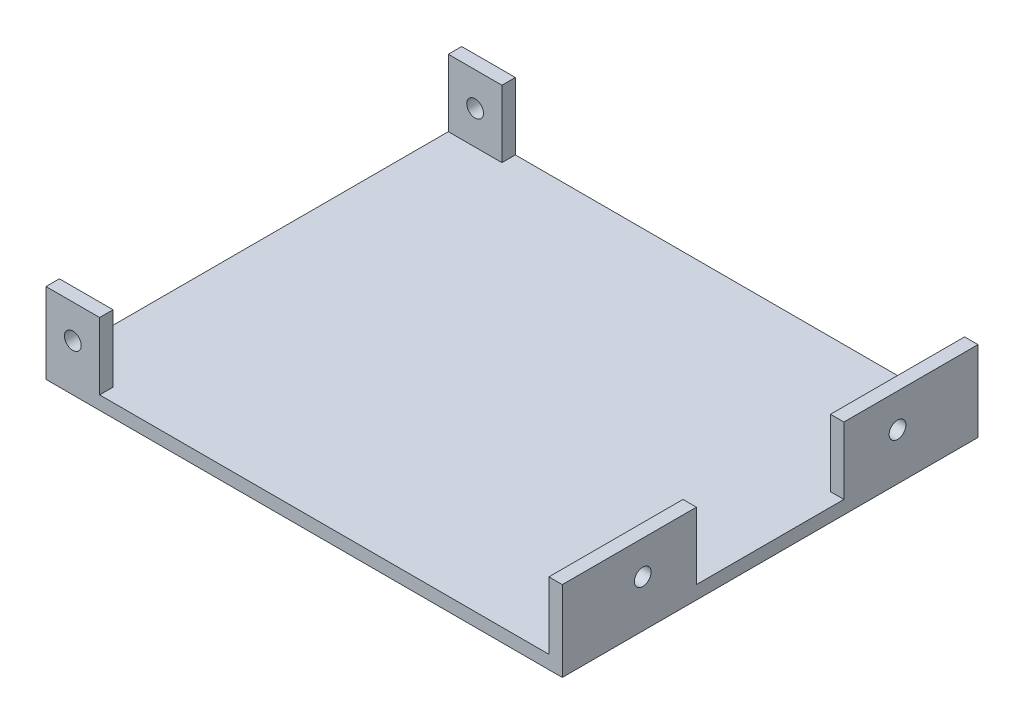
ISO-10303-21;
HEADER;
FILE_DESCRIPTION(('STEP AP214'),'2;1');
FILE_NAME('part.step','',(''),(''),'','','');
FILE_SCHEMA(('AUTOMOTIVE_DESIGN { 1 0 10303 214 1 1 1 1 }'));
ENDSEC;
DATA;
#1=APPLICATION_CONTEXT('core data for automotive mechanical design processes');
#2=APPLICATION_PROTOCOL_DEFINITION('international standard','automotive_design',2000,#1);
#3=PRODUCT_CONTEXT('',#1,'mechanical');
#4=PRODUCT('Part','Part','',(#3));
#5=PRODUCT_RELATED_PRODUCT_CATEGORY('part','',(#4));
#6=PRODUCT_DEFINITION_FORMATION('','',#4);
#7=PRODUCT_DEFINITION_CONTEXT('part definition',#1,'design');
#8=PRODUCT_DEFINITION('design','',#6,#7);
#9=PRODUCT_DEFINITION_SHAPE('','',#8);
#10=(LENGTH_UNIT() NAMED_UNIT(*) SI_UNIT(.MILLI.,.METRE.));
#11=(NAMED_UNIT(*) PLANE_ANGLE_UNIT() SI_UNIT($,.RADIAN.));
#12=(NAMED_UNIT(*) SI_UNIT($,.STERADIAN.) SOLID_ANGLE_UNIT());
#13=UNCERTAINTY_MEASURE_WITH_UNIT(LENGTH_MEASURE(1.E-05),#10,'distance_accuracy_value','');
#14=(GEOMETRIC_REPRESENTATION_CONTEXT(3) GLOBAL_UNCERTAINTY_ASSIGNED_CONTEXT((#13)) GLOBAL_UNIT_ASSIGNED_CONTEXT((#10,
#11,#12)) REPRESENTATION_CONTEXT('',''));
#15=CARTESIAN_POINT('',(0.,0.,0.));
#16=DIRECTION('',(0.,0.,1.));
#17=DIRECTION('',(1.,0.,0.));
#18=AXIS2_PLACEMENT_3D('',#15,#16,#17);
#19=CARTESIAN_POINT('',(0.,2.,0.));
#20=DIRECTION('',(0.,1.,0.));
#21=DIRECTION('',(0.,0.,1.));
#22=AXIS2_PLACEMENT_3D('',#19,#20,#21);
#23=PLANE('',#22);
#24=DIRECTION('',(0.,0.,1.));
#25=VECTOR('',#24,1.);
#26=CARTESIAN_POINT('',(-34.6952462244227,2.,13.1504824105864));
#27=LINE('',#26,#25);
#28=CARTESIAN_POINT('',(-34.6952462244227,2.,13.1504824105864));
#29=VERTEX_POINT('',#28);
#30=CARTESIAN_POINT('',(-34.6952462244227,2.,15.1504824105864));
#31=VERTEX_POINT('',#30);
#32=EDGE_CURVE('E161',#29,#31,#27,.T.);
#33=ORIENTED_EDGE('',*,*,#32,.T.);
#34=DIRECTION('',(1.,0.,0.));
#35=VECTOR('',#34,1.);
#36=CARTESIAN_POINT('',(-42.6952462244227,2.,15.1504824105864));
#37=LINE('',#36,#35);
#38=CARTESIAN_POINT('',(32.3047537755773,2.,15.1504824105864));
#39=VERTEX_POINT('',#38);
#40=EDGE_CURVE('E148',#31,#39,#37,.T.);
#41=ORIENTED_EDGE('',*,*,#40,.T.);
#42=DIRECTION('',(0.,0.,1.));
#43=VECTOR('',#42,1.);
#44=CARTESIAN_POINT('',(32.3047537755773,2.,-4.84951758941357));
#45=LINE('',#44,#43);
#46=CARTESIAN_POINT('',(32.3047537755773,2.,-4.84951758941357));
#47=VERTEX_POINT('',#46);
#48=EDGE_CURVE('E195',#47,#39,#45,.T.);
#49=ORIENTED_EDGE('',*,*,#48,.F.);
#50=DIRECTION('',(1.,0.,0.));
#51=VECTOR('',#50,1.);
#52=CARTESIAN_POINT('',(32.3047537755773,2.,-4.84951758941357));
#53=LINE('',#52,#51);
#54=CARTESIAN_POINT('',(34.3047537755773,2.,-4.84951758941357));
#55=VERTEX_POINT('',#54);
#56=EDGE_CURVE('E197',#47,#55,#53,.T.);
#57=ORIENTED_EDGE('',*,*,#56,.T.);
#58=DIRECTION('',(0.,0.,-1.));
#59=VECTOR('',#58,1.);
#60=CARTESIAN_POINT('',(34.3047537755773,2.,-46.8495175894136));
#61=LINE('',#60,#59);
#62=CARTESIAN_POINT('',(34.3047537755773,2.,-26.8495175894136));
#63=VERTEX_POINT('',#62);
#64=EDGE_CURVE('E158',#55,#63,#61,.T.);
#65=ORIENTED_EDGE('',*,*,#64,.T.);
#66=DIRECTION('',(1.,0.,0.));
#67=VECTOR('',#66,1.);
#68=CARTESIAN_POINT('',(32.3047537755773,2.,-26.8495175894136));
#69=LINE('',#68,#67);
#70=CARTESIAN_POINT('',(32.3047537755773,2.,-26.8495175894136));
#71=VERTEX_POINT('',#70);
#72=EDGE_CURVE('E221',#71,#63,#69,.T.);
#73=ORIENTED_EDGE('',*,*,#72,.F.);
#74=DIRECTION('',(0.,0.,1.));
#75=VECTOR('',#74,1.);
#76=CARTESIAN_POINT('',(32.3047537755773,2.,-46.8495175894136));
#77=LINE('',#76,#75);
#78=CARTESIAN_POINT('',(32.3047537755773,2.,-46.8495175894136));
#79=VERTEX_POINT('',#78);
#80=EDGE_CURVE('E219',#79,#71,#77,.T.);
#81=ORIENTED_EDGE('',*,*,#80,.F.);
#82=DIRECTION('',(-1.,0.,0.));
#83=VECTOR('',#82,1.);
#84=CARTESIAN_POINT('',(-42.6952462244227,2.,-46.8495175894136));
#85=LINE('',#84,#83);
#86=CARTESIAN_POINT('',(-34.6952462244227,2.,-46.8495175894136));
#87=VERTEX_POINT('',#86);
#88=EDGE_CURVE('E260',#79,#87,#85,.T.);
#89=ORIENTED_EDGE('',*,*,#88,.T.);
#90=DIRECTION('',(0.,0.,1.));
#91=VECTOR('',#90,1.);
#92=CARTESIAN_POINT('',(-34.6952462244227,2.,-46.8495175894136));
#93=LINE('',#92,#91);
#94=CARTESIAN_POINT('',(-34.6952462244227,2.,-44.8495175894136));
#95=VERTEX_POINT('',#94);
#96=EDGE_CURVE('E237',#87,#95,#93,.T.);
#97=ORIENTED_EDGE('',*,*,#96,.T.);
#98=DIRECTION('',(1.,0.,0.));
#99=VECTOR('',#98,1.);
#100=CARTESIAN_POINT('',(-42.6952462244227,2.,-44.8495175894136));
#101=LINE('',#100,#99);
#102=CARTESIAN_POINT('',(-42.6952462244227,2.,-44.8495175894136));
#103=VERTEX_POINT('',#102);
#104=EDGE_CURVE('E225',#103,#95,#101,.T.);
#105=ORIENTED_EDGE('',*,*,#104,.F.);
#106=DIRECTION('',(0.,0.,1.));
#107=VECTOR('',#106,1.);
#108=CARTESIAN_POINT('',(-42.6952462244227,2.,-46.8495175894136));
#109=LINE('',#108,#107);
#110=CARTESIAN_POINT('',(-42.6952462244227,2.,13.1504824105864));
#111=VERTEX_POINT('',#110);
#112=EDGE_CURVE('E54',#103,#111,#109,.T.);
#113=ORIENTED_EDGE('',*,*,#112,.T.);
#114=DIRECTION('',(1.,0.,0.));
#115=VECTOR('',#114,1.);
#116=CARTESIAN_POINT('',(-42.6952462244227,2.,13.1504824105864));
#117=LINE('',#116,#115);
#118=EDGE_CURVE('E49',#111,#29,#117,.T.);
#119=ORIENTED_EDGE('',*,*,#118,.T.);
#120=EDGE_LOOP('',(#33,#41,#49,#57,#65,#73,#81,#89,#97,#105,#113,#119));
#121=FACE_BOUND('',#120,.T.);
#122=ADVANCED_FACE('F33',(#121),#23,.T.);
#123=CARTESIAN_POINT('',(-42.6952462244227,2.,-46.8495175894136));
#124=DIRECTION('',(1.,0.,0.));
#125=DIRECTION('',(0.,0.,-1.));
#126=AXIS2_PLACEMENT_3D('',#123,#124,#125);
#127=PLANE('',#126);
#128=DIRECTION('',(0.,0.,1.));
#129=VECTOR('',#128,1.);
#130=CARTESIAN_POINT('',(-42.6952462244227,0.,-46.8495175894136));
#131=LINE('',#130,#129);
#132=CARTESIAN_POINT('',(-42.6952462244227,0.,-46.8495175894136));
#133=VERTEX_POINT('',#132);
#134=CARTESIAN_POINT('',(-42.6952462244227,0.,15.1504824105864));
#135=VERTEX_POINT('',#134);
#136=EDGE_CURVE('E256',#133,#135,#131,.T.);
#137=ORIENTED_EDGE('',*,*,#136,.T.);
#138=DIRECTION('',(0.,-1.,0.));
#139=VECTOR('',#138,1.);
#140=CARTESIAN_POINT('',(-42.6952462244227,2.,15.1504824105864));
#141=LINE('',#140,#139);
#142=CARTESIAN_POINT('',(-42.6952462244227,12.,15.1504824105864));
#143=VERTEX_POINT('',#142);
#144=EDGE_CURVE('E11',#143,#135,#141,.T.);
#145=ORIENTED_EDGE('',*,*,#144,.F.);
#146=DIRECTION('',(0.,0.,1.));
#147=VECTOR('',#146,1.);
#148=CARTESIAN_POINT('',(-42.6952462244227,12.,13.1504824105864));
#149=LINE('',#148,#147);
#150=CARTESIAN_POINT('',(-42.6952462244227,12.,13.1504824105864));
#151=VERTEX_POINT('',#150);
#152=EDGE_CURVE('E178',#151,#143,#149,.T.);
#153=ORIENTED_EDGE('',*,*,#152,.F.);
#154=DIRECTION('',(0.,-1.,0.));
#155=VECTOR('',#154,1.);
#156=CARTESIAN_POINT('',(-42.6952462244227,12.,13.1504824105864));
#157=LINE('',#156,#155);
#158=EDGE_CURVE('E171',#151,#111,#157,.T.);
#159=ORIENTED_EDGE('',*,*,#158,.T.);
#160=ORIENTED_EDGE('',*,*,#112,.F.);
#161=DIRECTION('',(0.,-1.,0.));
#162=VECTOR('',#161,1.);
#163=CARTESIAN_POINT('',(-42.6952462244227,12.,-44.8495175894136));
#164=LINE('',#163,#162);
#165=CARTESIAN_POINT('',(-42.6952462244227,12.,-44.8495175894136));
#166=VERTEX_POINT('',#165);
#167=EDGE_CURVE('E245',#166,#103,#164,.T.);
#168=ORIENTED_EDGE('',*,*,#167,.F.);
#169=DIRECTION('',(0.,0.,1.));
#170=VECTOR('',#169,1.);
#171=CARTESIAN_POINT('',(-42.6952462244227,12.,-46.8495175894136));
#172=LINE('',#171,#170);
#173=CARTESIAN_POINT('',(-42.6952462244227,12.,-46.8495175894136));
#174=VERTEX_POINT('',#173);
#175=EDGE_CURVE('E243',#174,#166,#172,.T.);
#176=ORIENTED_EDGE('',*,*,#175,.F.);
#177=DIRECTION('',(0.,-1.,0.));
#178=VECTOR('',#177,1.);
#179=CARTESIAN_POINT('',(-42.6952462244227,2.,-46.8495175894136));
#180=LINE('',#179,#178);
#181=EDGE_CURVE('E262',#174,#133,#180,.T.);
#182=ORIENTED_EDGE('',*,*,#181,.T.);
#183=EDGE_LOOP('',(#137,#145,#153,#159,#160,#168,#176,#182));
#184=FACE_BOUND('',#183,.T.);
#185=ADVANCED_FACE('F35',(#184),#127,.F.);
#186=CARTESIAN_POINT('',(-42.6952462244227,2.,15.1504824105864));
#187=DIRECTION('',(0.,0.,-1.));
#188=DIRECTION('',(-1.,0.,0.));
#189=AXIS2_PLACEMENT_3D('',#186,#187,#188);
#190=PLANE('',#189);
#191=CARTESIAN_POINT('',(-38.6952462244227,7.,15.1504824105864));
#192=DIRECTION('',(0.,0.,1.));
#193=DIRECTION('',(1.,0.,0.));
#194=AXIS2_PLACEMENT_3D('',#191,#192,#193);
#195=CIRCLE('',#194,1.25);
#196=CARTESIAN_POINT('',(-37.4452462244227,7.,15.1504824105864));
#197=VERTEX_POINT('',#196);
#198=EDGE_CURVE('E354',#197,#197,#195,.T.);
#199=ORIENTED_EDGE('',*,*,#198,.F.);
#200=EDGE_LOOP('',(#199));
#201=FACE_BOUND('',#200,.T.);
#202=DIRECTION('',(1.,0.,0.));
#203=VECTOR('',#202,1.);
#204=CARTESIAN_POINT('',(-42.6952462244227,0.,15.1504824105864));
#205=LINE('',#204,#203);
#206=CARTESIAN_POINT('',(34.3047537755773,0.,15.1504824105864));
#207=VERTEX_POINT('',#206);
#208=EDGE_CURVE('E265',#135,#207,#205,.T.);
#209=ORIENTED_EDGE('',*,*,#208,.T.);
#210=DIRECTION('',(0.,-1.,0.));
#211=VECTOR('',#210,1.);
#212=CARTESIAN_POINT('',(34.3047537755773,2.,15.1504824105864));
#213=LINE('',#212,#211);
#214=CARTESIAN_POINT('',(34.3047537755773,12.,15.1504824105864));
#215=VERTEX_POINT('',#214);
#216=EDGE_CURVE('E42',#215,#207,#213,.T.);
#217=ORIENTED_EDGE('',*,*,#216,.F.);
#218=DIRECTION('',(1.,0.,0.));
#219=VECTOR('',#218,1.);
#220=CARTESIAN_POINT('',(32.3047537755773,12.,15.1504824105864));
#221=LINE('',#220,#219);
#222=CARTESIAN_POINT('',(32.3047537755773,12.,15.1504824105864));
#223=VERTEX_POINT('',#222);
#224=EDGE_CURVE('E198',#223,#215,#221,.T.);
#225=ORIENTED_EDGE('',*,*,#224,.F.);
#226=DIRECTION('',(0.,-1.,0.));
#227=VECTOR('',#226,1.);
#228=CARTESIAN_POINT('',(32.3047537755773,12.,15.1504824105864));
#229=LINE('',#228,#227);
#230=EDGE_CURVE('E156',#223,#39,#229,.T.);
#231=ORIENTED_EDGE('',*,*,#230,.T.);
#232=ORIENTED_EDGE('',*,*,#40,.F.);
#233=DIRECTION('',(0.,-1.,0.));
#234=VECTOR('',#233,1.);
#235=CARTESIAN_POINT('',(-34.6952462244227,12.,15.1504824105864));
#236=LINE('',#235,#234);
#237=CARTESIAN_POINT('',(-34.6952462244227,12.,15.1504824105864));
#238=VERTEX_POINT('',#237);
#239=EDGE_CURVE('E152',#238,#31,#236,.T.);
#240=ORIENTED_EDGE('',*,*,#239,.F.);
#241=DIRECTION('',(1.,0.,0.));
#242=VECTOR('',#241,1.);
#243=CARTESIAN_POINT('',(-42.6952462244227,12.,15.1504824105864));
#244=LINE('',#243,#242);
#245=EDGE_CURVE('E179',#143,#238,#244,.T.);
#246=ORIENTED_EDGE('',*,*,#245,.F.);
#247=ORIENTED_EDGE('',*,*,#144,.T.);
#248=EDGE_LOOP('',(#209,#217,#225,#231,#232,#240,#246,#247));
#249=FACE_BOUND('',#248,.T.);
#250=ADVANCED_FACE('F149',(#201,#249),#190,.F.);
#251=CARTESIAN_POINT('',(34.3047537755773,2.,-46.8495175894136));
#252=DIRECTION('',(-1.,0.,0.));
#253=DIRECTION('',(0.,0.,1.));
#254=AXIS2_PLACEMENT_3D('',#251,#252,#253);
#255=PLANE('',#254);
#256=CARTESIAN_POINT('',(34.3047537755773,7.,3.15048241058643));
#257=DIRECTION('',(1.,0.,0.));
#258=DIRECTION('',(0.,0.,-1.));
#259=AXIS2_PLACEMENT_3D('',#256,#257,#258);
#260=CIRCLE('',#259,1.25);
#261=CARTESIAN_POINT('',(34.3047537755773,7.,1.90048241058643));
#262=VERTEX_POINT('',#261);
#263=EDGE_CURVE('E361',#262,#262,#260,.T.);
#264=ORIENTED_EDGE('',*,*,#263,.F.);
#265=EDGE_LOOP('',(#264));
#266=FACE_BOUND('',#265,.T.);
#267=CARTESIAN_POINT('',(34.3047537755773,7.,-34.8495175894136));
#268=DIRECTION('',(1.,0.,0.));
#269=DIRECTION('',(0.,0.,-1.));
#270=AXIS2_PLACEMENT_3D('',#267,#268,#269);
#271=CIRCLE('',#270,1.25);
#272=CARTESIAN_POINT('',(34.3047537755773,7.,-36.0995175894136));
#273=VERTEX_POINT('',#272);
#274=EDGE_CURVE('E367',#273,#273,#271,.T.);
#275=ORIENTED_EDGE('',*,*,#274,.F.);
#276=EDGE_LOOP('',(#275));
#277=FACE_BOUND('',#276,.T.);
#278=DIRECTION('',(0.,0.,-1.));
#279=VECTOR('',#278,1.);
#280=CARTESIAN_POINT('',(34.3047537755773,0.,-46.8495175894136));
#281=LINE('',#280,#279);
#282=CARTESIAN_POINT('',(34.3047537755773,0.,-46.8495175894136));
#283=VERTEX_POINT('',#282);
#284=EDGE_CURVE('E267',#207,#283,#281,.T.);
#285=ORIENTED_EDGE('',*,*,#284,.T.);
#286=DIRECTION('',(0.,-1.,0.));
#287=VECTOR('',#286,1.);
#288=CARTESIAN_POINT('',(34.3047537755773,2.,-46.8495175894136));
#289=LINE('',#288,#287);
#290=CARTESIAN_POINT('',(34.3047537755773,12.,-46.8495175894136));
#291=VERTEX_POINT('',#290);
#292=EDGE_CURVE('E272',#291,#283,#289,.T.);
#293=ORIENTED_EDGE('',*,*,#292,.F.);
#294=DIRECTION('',(0.,0.,1.));
#295=VECTOR('',#294,1.);
#296=CARTESIAN_POINT('',(34.3047537755773,12.,-46.8495175894136));
#297=LINE('',#296,#295);
#298=CARTESIAN_POINT('',(34.3047537755773,12.,-26.8495175894136));
#299=VERTEX_POINT('',#298);
#300=EDGE_CURVE('E230',#291,#299,#297,.T.);
#301=ORIENTED_EDGE('',*,*,#300,.T.);
#302=DIRECTION('',(0.,-1.,0.));
#303=VECTOR('',#302,1.);
#304=CARTESIAN_POINT('',(34.3047537755773,12.,-26.8495175894136));
#305=LINE('',#304,#303);
#306=EDGE_CURVE('E201',#299,#63,#305,.T.);
#307=ORIENTED_EDGE('',*,*,#306,.T.);
#308=ORIENTED_EDGE('',*,*,#64,.F.);
#309=DIRECTION('',(0.,-1.,0.));
#310=VECTOR('',#309,1.);
#311=CARTESIAN_POINT('',(34.3047537755773,12.,-4.84951758941357));
#312=LINE('',#311,#310);
#313=CARTESIAN_POINT('',(34.3047537755773,12.,-4.84951758941357));
#314=VERTEX_POINT('',#313);
#315=EDGE_CURVE('E163',#314,#55,#312,.T.);
#316=ORIENTED_EDGE('',*,*,#315,.F.);
#317=DIRECTION('',(0.,0.,1.));
#318=VECTOR('',#317,1.);
#319=CARTESIAN_POINT('',(34.3047537755773,12.,-4.84951758941357));
#320=LINE('',#319,#318);
#321=EDGE_CURVE('E206',#314,#215,#320,.T.);
#322=ORIENTED_EDGE('',*,*,#321,.T.);
#323=ORIENTED_EDGE('',*,*,#216,.T.);
#324=EDGE_LOOP('',(#285,#293,#301,#307,#308,#316,#322,#323));
#325=FACE_BOUND('',#324,.T.);
#326=ADVANCED_FACE('F278',(#266,#277,#325),#255,.F.);
#327=CARTESIAN_POINT('',(-42.6952462244227,2.,-46.8495175894136));
#328=DIRECTION('',(0.,0.,1.));
#329=DIRECTION('',(1.,0.,0.));
#330=AXIS2_PLACEMENT_3D('',#327,#328,#329);
#331=PLANE('',#330);
#332=CARTESIAN_POINT('',(-38.6952462244227,7.,-46.8495175894136));
#333=DIRECTION('',(0.,0.,1.));
#334=DIRECTION('',(1.,0.,0.));
#335=AXIS2_PLACEMENT_3D('',#332,#333,#334);
#336=CIRCLE('',#335,1.25);
#337=CARTESIAN_POINT('',(-37.4452462244227,7.,-46.8495175894136));
#338=VERTEX_POINT('',#337);
#339=EDGE_CURVE('E356',#338,#338,#336,.T.);
#340=ORIENTED_EDGE('',*,*,#339,.T.);
#341=EDGE_LOOP('',(#340));
#342=FACE_BOUND('',#341,.T.);
#343=DIRECTION('',(-1.,0.,0.));
#344=VECTOR('',#343,1.);
#345=CARTESIAN_POINT('',(-42.6952462244227,0.,-46.8495175894136));
#346=LINE('',#345,#344);
#347=EDGE_CURVE('E257',#283,#133,#346,.T.);
#348=ORIENTED_EDGE('',*,*,#347,.T.);
#349=ORIENTED_EDGE('',*,*,#181,.F.);
#350=DIRECTION('',(1.,0.,0.));
#351=VECTOR('',#350,1.);
#352=CARTESIAN_POINT('',(-42.6952462244227,12.,-46.8495175894136));
#353=LINE('',#352,#351);
#354=CARTESIAN_POINT('',(-34.6952462244227,12.,-46.8495175894136));
#355=VERTEX_POINT('',#354);
#356=EDGE_CURVE('E240',#174,#355,#353,.T.);
#357=ORIENTED_EDGE('',*,*,#356,.T.);
#358=DIRECTION('',(0.,-1.,0.));
#359=VECTOR('',#358,1.);
#360=CARTESIAN_POINT('',(-34.6952462244227,12.,-46.8495175894136));
#361=LINE('',#360,#359);
#362=EDGE_CURVE('E250',#355,#87,#361,.T.);
#363=ORIENTED_EDGE('',*,*,#362,.T.);
#364=ORIENTED_EDGE('',*,*,#88,.F.);
#365=DIRECTION('',(0.,-1.,0.));
#366=VECTOR('',#365,1.);
#367=CARTESIAN_POINT('',(32.3047537755773,12.,-46.8495175894136));
#368=LINE('',#367,#366);
#369=CARTESIAN_POINT('',(32.3047537755773,12.,-46.8495175894136));
#370=VERTEX_POINT('',#369);
#371=EDGE_CURVE('E213',#370,#79,#368,.T.);
#372=ORIENTED_EDGE('',*,*,#371,.F.);
#373=DIRECTION('',(1.,0.,0.));
#374=VECTOR('',#373,1.);
#375=CARTESIAN_POINT('',(32.3047537755773,12.,-46.8495175894136));
#376=LINE('',#375,#374);
#377=EDGE_CURVE('E227',#370,#291,#376,.T.);
#378=ORIENTED_EDGE('',*,*,#377,.T.);
#379=ORIENTED_EDGE('',*,*,#292,.T.);
#380=EDGE_LOOP('',(#348,#349,#357,#363,#364,#372,#378,#379));
#381=FACE_BOUND('',#380,.T.);
#382=ADVANCED_FACE('F285',(#342,#381),#331,.F.);
#383=CARTESIAN_POINT('',(0.,0.,0.));
#384=DIRECTION('',(0.,1.,0.));
#385=DIRECTION('',(0.,0.,1.));
#386=AXIS2_PLACEMENT_3D('',#383,#384,#385);
#387=PLANE('',#386);
#388=ORIENTED_EDGE('',*,*,#136,.F.);
#389=ORIENTED_EDGE('',*,*,#347,.F.);
#390=ORIENTED_EDGE('',*,*,#284,.F.);
#391=ORIENTED_EDGE('',*,*,#208,.F.);
#392=EDGE_LOOP('',(#388,#389,#390,#391));
#393=FACE_BOUND('',#392,.T.);
#394=ADVANCED_FACE('F283',(#393),#387,.F.);
#395=CARTESIAN_POINT('',(-42.6952462244227,12.,-44.8495175894136));
#396=DIRECTION('',(0.,0.,-1.));
#397=DIRECTION('',(-1.,0.,0.));
#398=AXIS2_PLACEMENT_3D('',#395,#396,#397);
#399=PLANE('',#398);
#400=CARTESIAN_POINT('',(-38.6952462244227,7.,-44.8495175894136));
#401=DIRECTION('',(0.,0.,-1.));
#402=DIRECTION('',(-1.,0.,0.));
#403=AXIS2_PLACEMENT_3D('',#400,#401,#402);
#404=CIRCLE('',#403,1.25);
#405=CARTESIAN_POINT('',(-39.9452462244227,7.,-44.8495175894136));
#406=VERTEX_POINT('',#405);
#407=EDGE_CURVE('E169',#406,#406,#404,.T.);
#408=ORIENTED_EDGE('',*,*,#407,.T.);
#409=EDGE_LOOP('',(#408));
#410=FACE_BOUND('',#409,.T.);
#411=ORIENTED_EDGE('',*,*,#104,.T.);
#412=DIRECTION('',(0.,-1.,0.));
#413=VECTOR('',#412,1.);
#414=CARTESIAN_POINT('',(-34.6952462244227,12.,-44.8495175894136));
#415=LINE('',#414,#413);
#416=CARTESIAN_POINT('',(-34.6952462244227,12.,-44.8495175894136));
#417=VERTEX_POINT('',#416);
#418=EDGE_CURVE('E253',#417,#95,#415,.T.);
#419=ORIENTED_EDGE('',*,*,#418,.F.);
#420=DIRECTION('',(1.,0.,0.));
#421=VECTOR('',#420,1.);
#422=CARTESIAN_POINT('',(-42.6952462244227,12.,-44.8495175894136));
#423=LINE('',#422,#421);
#424=EDGE_CURVE('E234',#166,#417,#423,.T.);
#425=ORIENTED_EDGE('',*,*,#424,.F.);
#426=ORIENTED_EDGE('',*,*,#167,.T.);
#427=EDGE_LOOP('',(#411,#419,#425,#426));
#428=FACE_BOUND('',#427,.T.);
#429=ADVANCED_FACE('F339',(#410,#428),#399,.F.);
#430=CARTESIAN_POINT('',(-34.6952462244227,12.,-46.8495175894136));
#431=DIRECTION('',(1.,0.,0.));
#432=DIRECTION('',(0.,0.,-1.));
#433=AXIS2_PLACEMENT_3D('',#430,#431,#432);
#434=PLANE('',#433);
#435=ORIENTED_EDGE('',*,*,#96,.F.);
#436=ORIENTED_EDGE('',*,*,#362,.F.);
#437=DIRECTION('',(0.,0.,1.));
#438=VECTOR('',#437,1.);
#439=CARTESIAN_POINT('',(-34.6952462244227,12.,-46.8495175894136));
#440=LINE('',#439,#438);
#441=EDGE_CURVE('E236',#355,#417,#440,.T.);
#442=ORIENTED_EDGE('',*,*,#441,.T.);
#443=ORIENTED_EDGE('',*,*,#418,.T.);
#444=EDGE_LOOP('',(#435,#436,#442,#443));
#445=FACE_BOUND('',#444,.T.);
#446=ADVANCED_FACE('F297',(#445),#434,.T.);
#447=CARTESIAN_POINT('',(0.,12.,0.));
#448=DIRECTION('',(0.,-1.,0.));
#449=DIRECTION('',(0.,0.,-1.));
#450=AXIS2_PLACEMENT_3D('',#447,#448,#449);
#451=PLANE('',#450);
#452=ORIENTED_EDGE('',*,*,#424,.T.);
#453=ORIENTED_EDGE('',*,*,#441,.F.);
#454=ORIENTED_EDGE('',*,*,#356,.F.);
#455=ORIENTED_EDGE('',*,*,#175,.T.);
#456=EDGE_LOOP('',(#452,#453,#454,#455));
#457=FACE_BOUND('',#456,.T.);
#458=ADVANCED_FACE('F293',(#457),#451,.F.);
#459=CARTESIAN_POINT('',(32.3047537755773,12.,-26.8495175894136));
#460=DIRECTION('',(0.,0.,-1.));
#461=DIRECTION('',(-1.,0.,0.));
#462=AXIS2_PLACEMENT_3D('',#459,#460,#461);
#463=PLANE('',#462);
#464=ORIENTED_EDGE('',*,*,#72,.T.);
#465=ORIENTED_EDGE('',*,*,#306,.F.);
#466=DIRECTION('',(1.,0.,0.));
#467=VECTOR('',#466,1.);
#468=CARTESIAN_POINT('',(32.3047537755773,12.,-26.8495175894136));
#469=LINE('',#468,#467);
#470=CARTESIAN_POINT('',(32.3047537755773,12.,-26.8495175894136));
#471=VERTEX_POINT('',#470);
#472=EDGE_CURVE('E222',#471,#299,#469,.T.);
#473=ORIENTED_EDGE('',*,*,#472,.F.);
#474=DIRECTION('',(0.,-1.,0.));
#475=VECTOR('',#474,1.);
#476=CARTESIAN_POINT('',(32.3047537755773,12.,-26.8495175894136));
#477=LINE('',#476,#475);
#478=EDGE_CURVE('E215',#471,#71,#477,.T.);
#479=ORIENTED_EDGE('',*,*,#478,.T.);
#480=EDGE_LOOP('',(#464,#465,#473,#479));
#481=FACE_BOUND('',#480,.T.);
#482=ADVANCED_FACE('F307',(#481),#463,.F.);
#483=CARTESIAN_POINT('',(32.3047537755773,12.,-46.8495175894136));
#484=DIRECTION('',(1.,0.,0.));
#485=DIRECTION('',(0.,0.,-1.));
#486=AXIS2_PLACEMENT_3D('',#483,#484,#485);
#487=PLANE('',#486);
#488=CARTESIAN_POINT('',(32.3047537755773,7.,-34.8495175894136));
#489=DIRECTION('',(1.,0.,0.));
#490=DIRECTION('',(0.,0.,-1.));
#491=AXIS2_PLACEMENT_3D('',#488,#489,#490);
#492=CIRCLE('',#491,1.25);
#493=CARTESIAN_POINT('',(32.3047537755773,7.,-36.0995175894136));
#494=VERTEX_POINT('',#493);
#495=EDGE_CURVE('E364',#494,#494,#492,.F.);
#496=ORIENTED_EDGE('',*,*,#495,.F.);
#497=EDGE_LOOP('',(#496));
#498=FACE_BOUND('',#497,.T.);
#499=ORIENTED_EDGE('',*,*,#80,.T.);
#500=ORIENTED_EDGE('',*,*,#478,.F.);
#501=DIRECTION('',(0.,0.,1.));
#502=VECTOR('',#501,1.);
#503=CARTESIAN_POINT('',(32.3047537755773,12.,-46.8495175894136));
#504=LINE('',#503,#502);
#505=EDGE_CURVE('E218',#370,#471,#504,.T.);
#506=ORIENTED_EDGE('',*,*,#505,.F.);
#507=ORIENTED_EDGE('',*,*,#371,.T.);
#508=EDGE_LOOP('',(#499,#500,#506,#507));
#509=FACE_BOUND('',#508,.T.);
#510=ADVANCED_FACE('F303',(#498,#509),#487,.F.);
#511=CARTESIAN_POINT('',(0.,12.,0.));
#512=DIRECTION('',(0.,-1.,0.));
#513=DIRECTION('',(0.,0.,-1.));
#514=AXIS2_PLACEMENT_3D('',#511,#512,#513);
#515=PLANE('',#514);
#516=ORIENTED_EDGE('',*,*,#472,.T.);
#517=ORIENTED_EDGE('',*,*,#300,.F.);
#518=ORIENTED_EDGE('',*,*,#377,.F.);
#519=ORIENTED_EDGE('',*,*,#505,.T.);
#520=EDGE_LOOP('',(#516,#517,#518,#519));
#521=FACE_BOUND('',#520,.T.);
#522=ADVANCED_FACE('F311',(#521),#515,.F.);
#523=CARTESIAN_POINT('',(32.3047537755773,12.,-4.84951758941357));
#524=DIRECTION('',(0.,0.,-1.));
#525=DIRECTION('',(-1.,0.,0.));
#526=AXIS2_PLACEMENT_3D('',#523,#524,#525);
#527=PLANE('',#526);
#528=ORIENTED_EDGE('',*,*,#56,.F.);
#529=DIRECTION('',(0.,-1.,0.));
#530=VECTOR('',#529,1.);
#531=CARTESIAN_POINT('',(32.3047537755773,12.,-4.84951758941357));
#532=LINE('',#531,#530);
#533=CARTESIAN_POINT('',(32.3047537755773,12.,-4.84951758941357));
#534=VERTEX_POINT('',#533);
#535=EDGE_CURVE('E190',#534,#47,#532,.T.);
#536=ORIENTED_EDGE('',*,*,#535,.F.);
#537=DIRECTION('',(1.,0.,0.));
#538=VECTOR('',#537,1.);
#539=CARTESIAN_POINT('',(32.3047537755773,12.,-4.84951758941357));
#540=LINE('',#539,#538);
#541=EDGE_CURVE('E203',#534,#314,#540,.T.);
#542=ORIENTED_EDGE('',*,*,#541,.T.);
#543=ORIENTED_EDGE('',*,*,#315,.T.);
#544=EDGE_LOOP('',(#528,#536,#542,#543));
#545=FACE_BOUND('',#544,.T.);
#546=ADVANCED_FACE('F315',(#545),#527,.T.);
#547=CARTESIAN_POINT('',(32.3047537755773,12.,-4.84951758941357));
#548=DIRECTION('',(1.,0.,0.));
#549=DIRECTION('',(0.,0.,-1.));
#550=AXIS2_PLACEMENT_3D('',#547,#548,#549);
#551=PLANE('',#550);
#552=CARTESIAN_POINT('',(32.3047537755773,7.,3.15048241058643));
#553=DIRECTION('',(1.,0.,0.));
#554=DIRECTION('',(0.,0.,-1.));
#555=AXIS2_PLACEMENT_3D('',#552,#553,#554);
#556=CIRCLE('',#555,1.25);
#557=CARTESIAN_POINT('',(32.3047537755773,7.,1.90048241058643));
#558=VERTEX_POINT('',#557);
#559=EDGE_CURVE('E357',#558,#558,#556,.F.);
#560=ORIENTED_EDGE('',*,*,#559,.F.);
#561=EDGE_LOOP('',(#560));
#562=FACE_BOUND('',#561,.T.);
#563=ORIENTED_EDGE('',*,*,#48,.T.);
#564=ORIENTED_EDGE('',*,*,#230,.F.);
#565=DIRECTION('',(0.,0.,1.));
#566=VECTOR('',#565,1.);
#567=CARTESIAN_POINT('',(32.3047537755773,12.,-4.84951758941357));
#568=LINE('',#567,#566);
#569=EDGE_CURVE('E194',#534,#223,#568,.T.);
#570=ORIENTED_EDGE('',*,*,#569,.F.);
#571=ORIENTED_EDGE('',*,*,#535,.T.);
#572=EDGE_LOOP('',(#563,#564,#570,#571));
#573=FACE_BOUND('',#572,.T.);
#574=ADVANCED_FACE('F321',(#562,#573),#551,.F.);
#575=CARTESIAN_POINT('',(0.,12.,0.));
#576=DIRECTION('',(0.,-1.,0.));
#577=DIRECTION('',(0.,0.,-1.));
#578=AXIS2_PLACEMENT_3D('',#575,#576,#577);
#579=PLANE('',#578);
#580=ORIENTED_EDGE('',*,*,#224,.T.);
#581=ORIENTED_EDGE('',*,*,#321,.F.);
#582=ORIENTED_EDGE('',*,*,#541,.F.);
#583=ORIENTED_EDGE('',*,*,#569,.T.);
#584=EDGE_LOOP('',(#580,#581,#582,#583));
#585=FACE_BOUND('',#584,.T.);
#586=ADVANCED_FACE('F319',(#585),#579,.F.);
#587=CARTESIAN_POINT('',(-34.6952462244227,12.,13.1504824105864));
#588=DIRECTION('',(1.,0.,0.));
#589=DIRECTION('',(0.,0.,-1.));
#590=AXIS2_PLACEMENT_3D('',#587,#588,#589);
#591=PLANE('',#590);
#592=ORIENTED_EDGE('',*,*,#32,.F.);
#593=DIRECTION('',(0.,-1.,0.));
#594=VECTOR('',#593,1.);
#595=CARTESIAN_POINT('',(-34.6952462244227,12.,13.1504824105864));
#596=LINE('',#595,#594);
#597=CARTESIAN_POINT('',(-34.6952462244227,12.,13.1504824105864));
#598=VERTEX_POINT('',#597);
#599=EDGE_CURVE('E168',#598,#29,#596,.T.);
#600=ORIENTED_EDGE('',*,*,#599,.F.);
#601=DIRECTION('',(0.,0.,1.));
#602=VECTOR('',#601,1.);
#603=CARTESIAN_POINT('',(-34.6952462244227,12.,13.1504824105864));
#604=LINE('',#603,#602);
#605=EDGE_CURVE('E167',#598,#238,#604,.T.);
#606=ORIENTED_EDGE('',*,*,#605,.T.);
#607=ORIENTED_EDGE('',*,*,#239,.T.);
#608=EDGE_LOOP('',(#592,#600,#606,#607));
#609=FACE_BOUND('',#608,.T.);
#610=ADVANCED_FACE('F165',(#609),#591,.T.);
#611=CARTESIAN_POINT('',(-42.6952462244227,12.,13.1504824105864));
#612=DIRECTION('',(0.,0.,-1.));
#613=DIRECTION('',(-1.,0.,0.));
#614=AXIS2_PLACEMENT_3D('',#611,#612,#613);
#615=PLANE('',#614);
#616=CARTESIAN_POINT('',(-38.6952462244227,7.,13.1504824105864));
#617=DIRECTION('',(0.,0.,-1.));
#618=DIRECTION('',(-1.,0.,0.));
#619=AXIS2_PLACEMENT_3D('',#616,#617,#618);
#620=CIRCLE('',#619,1.25);
#621=CARTESIAN_POINT('',(-39.9452462244227,7.,13.1504824105864));
#622=VERTEX_POINT('',#621);
#623=EDGE_CURVE('E37',#622,#622,#620,.T.);
#624=ORIENTED_EDGE('',*,*,#623,.F.);
#625=EDGE_LOOP('',(#624));
#626=FACE_BOUND('',#625,.T.);
#627=ORIENTED_EDGE('',*,*,#118,.F.);
#628=ORIENTED_EDGE('',*,*,#158,.F.);
#629=DIRECTION('',(1.,0.,0.));
#630=VECTOR('',#629,1.);
#631=CARTESIAN_POINT('',(-42.6952462244227,12.,13.1504824105864));
#632=LINE('',#631,#630);
#633=EDGE_CURVE('E183',#151,#598,#632,.T.);
#634=ORIENTED_EDGE('',*,*,#633,.T.);
#635=ORIENTED_EDGE('',*,*,#599,.T.);
#636=EDGE_LOOP('',(#627,#628,#634,#635));
#637=FACE_BOUND('',#636,.T.);
#638=ADVANCED_FACE('F420',(#626,#637),#615,.T.);
#639=CARTESIAN_POINT('',(0.,12.,0.));
#640=DIRECTION('',(0.,-1.,0.));
#641=DIRECTION('',(0.,0.,-1.));
#642=AXIS2_PLACEMENT_3D('',#639,#640,#641);
#643=PLANE('',#642);
#644=ORIENTED_EDGE('',*,*,#245,.T.);
#645=ORIENTED_EDGE('',*,*,#605,.F.);
#646=ORIENTED_EDGE('',*,*,#633,.F.);
#647=ORIENTED_EDGE('',*,*,#152,.T.);
#648=EDGE_LOOP('',(#644,#645,#646,#647));
#649=FACE_BOUND('',#648,.T.);
#650=ADVANCED_FACE('F414',(#649),#643,.F.);
#651=CARTESIAN_POINT('',(-38.6952462244227,7.,-46.8495175894136));
#652=DIRECTION('',(0.,0.,1.));
#653=DIRECTION('',(1.,0.,0.));
#654=AXIS2_PLACEMENT_3D('',#651,#652,#653);
#655=CYLINDRICAL_SURFACE('',#654,1.25);
#656=ORIENTED_EDGE('',*,*,#623,.T.);
#657=EDGE_LOOP('',(#656));
#658=FACE_BOUND('',#657,.T.);
#659=ORIENTED_EDGE('',*,*,#198,.T.);
#660=EDGE_LOOP('',(#659));
#661=FACE_BOUND('',#660,.T.);
#662=ADVANCED_FACE('F406',(#658,#661),#655,.F.);
#663=ORIENTED_EDGE('',*,*,#339,.F.);
#664=EDGE_LOOP('',(#663));
#665=FACE_BOUND('',#664,.T.);
#666=ORIENTED_EDGE('',*,*,#407,.F.);
#667=EDGE_LOOP('',(#666));
#668=FACE_BOUND('',#667,.T.);
#669=ADVANCED_FACE('F404',(#665,#668),#655,.F.);
#670=CARTESIAN_POINT('',(-42.6962462244227,7.,3.15048241058643));
#671=DIRECTION('',(1.,0.,0.));
#672=DIRECTION('',(0.,0.,-1.));
#673=AXIS2_PLACEMENT_3D('',#670,#671,#672);
#674=CYLINDRICAL_SURFACE('',#673,1.25);
#675=ORIENTED_EDGE('',*,*,#263,.T.);
#676=EDGE_LOOP('',(#675));
#677=FACE_BOUND('',#676,.T.);
#678=ORIENTED_EDGE('',*,*,#559,.T.);
#679=EDGE_LOOP('',(#678));
#680=FACE_BOUND('',#679,.T.);
#681=ADVANCED_FACE('F373',(#677,#680),#674,.F.);
#682=CARTESIAN_POINT('',(-42.6962462244227,7.,-34.8495175894136));
#683=DIRECTION('',(1.,0.,0.));
#684=DIRECTION('',(0.,0.,-1.));
#685=AXIS2_PLACEMENT_3D('',#682,#683,#684);
#686=CYLINDRICAL_SURFACE('',#685,1.25);
#687=ORIENTED_EDGE('',*,*,#274,.T.);
#688=EDGE_LOOP('',(#687));
#689=FACE_BOUND('',#688,.T.);
#690=ORIENTED_EDGE('',*,*,#495,.T.);
#691=EDGE_LOOP('',(#690));
#692=FACE_BOUND('',#691,.T.);
#693=ADVANCED_FACE('F378',(#689,#692),#686,.F.);
#694=CLOSED_SHELL('',(#122,#185,#250,#326,#382,#394,#429,#446,#458,#482,#510,#522,#546,#574,
#586,#610,#638,#650,#662,#669,#681,#693));
#695=MANIFOLD_SOLID_BREP('B2',#694);
#696=ADVANCED_BREP_SHAPE_REPRESENTATION('',(#18,#695),#14);
#697=SHAPE_DEFINITION_REPRESENTATION(#9,#696);
ENDSEC;
END-ISO-10303-21;
